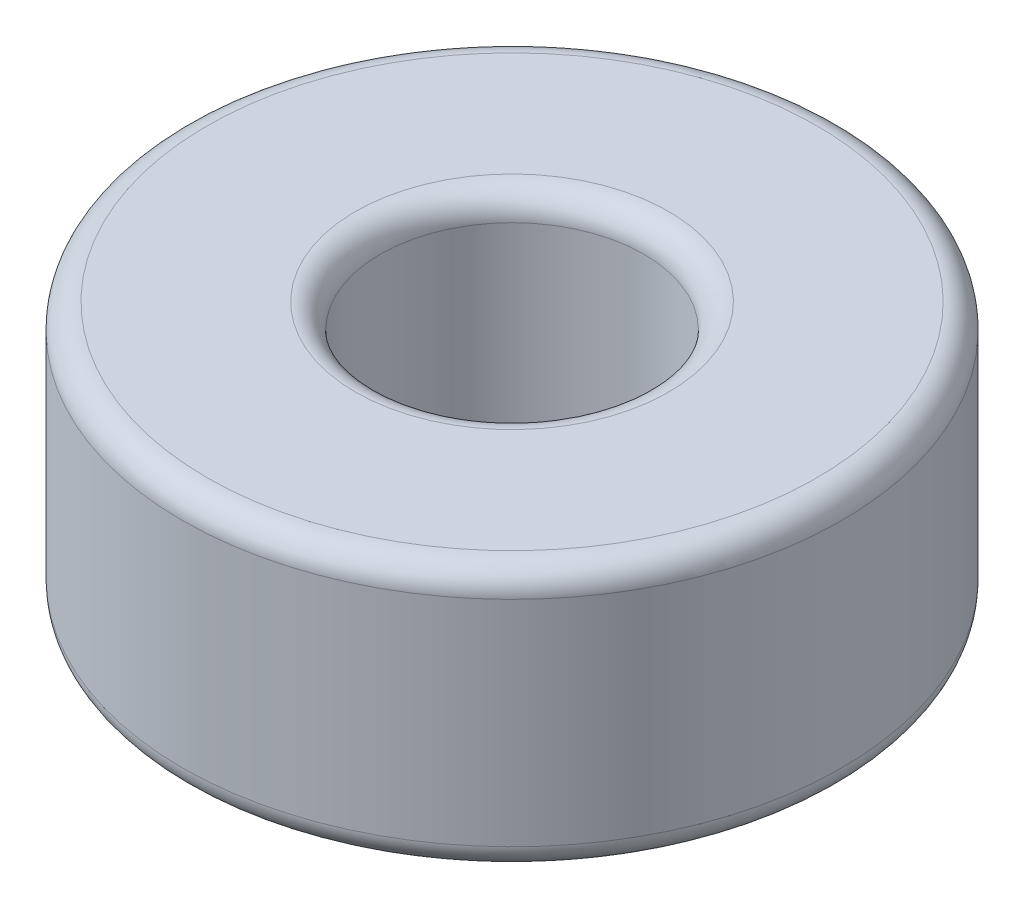
ISO-10303-21;
HEADER;
FILE_DESCRIPTION(('STEP AP214'),'2;1');
FILE_NAME('part.step','',(''),(''),'','','');
FILE_SCHEMA(('AUTOMOTIVE_DESIGN { 1 0 10303 214 1 1 1 1 }'));
ENDSEC;
DATA;
#1=APPLICATION_CONTEXT('core data for automotive mechanical design processes');
#2=APPLICATION_PROTOCOL_DEFINITION('international standard','automotive_design',2000,#1);
#3=PRODUCT_CONTEXT('',#1,'mechanical');
#4=PRODUCT('Part','Part','',(#3));
#5=PRODUCT_RELATED_PRODUCT_CATEGORY('part','',(#4));
#6=PRODUCT_DEFINITION_FORMATION('','',#4);
#7=PRODUCT_DEFINITION_CONTEXT('part definition',#1,'design');
#8=PRODUCT_DEFINITION('design','',#6,#7);
#9=PRODUCT_DEFINITION_SHAPE('','',#8);
#10=(LENGTH_UNIT() NAMED_UNIT(*) SI_UNIT(.MILLI.,.METRE.));
#11=(NAMED_UNIT(*) PLANE_ANGLE_UNIT() SI_UNIT($,.RADIAN.));
#12=(NAMED_UNIT(*) SI_UNIT($,.STERADIAN.) SOLID_ANGLE_UNIT());
#13=UNCERTAINTY_MEASURE_WITH_UNIT(LENGTH_MEASURE(1.E-05),#10,'distance_accuracy_value','');
#14=(GEOMETRIC_REPRESENTATION_CONTEXT(3) GLOBAL_UNCERTAINTY_ASSIGNED_CONTEXT((#13)) GLOBAL_UNIT_ASSIGNED_CONTEXT((#10,
#11,#12)) REPRESENTATION_CONTEXT('',''));
#15=CARTESIAN_POINT('',(0.,0.,0.));
#16=DIRECTION('',(0.,0.,1.));
#17=DIRECTION('',(1.,0.,0.));
#18=AXIS2_PLACEMENT_3D('',#15,#16,#17);
#19=CARTESIAN_POINT('',(0.,2.,0.));
#20=DIRECTION('',(0.,-1.,0.));
#21=DIRECTION('',(0.,0.,-1.));
#22=AXIS2_PLACEMENT_3D('',#19,#20,#21);
#23=CYLINDRICAL_SURFACE('',#22,5.);
#24=CARTESIAN_POINT('',(0.,-1.625,0.));
#25=DIRECTION('',(0.,1.,0.));
#26=DIRECTION('',(0.,0.,1.));
#27=AXIS2_PLACEMENT_3D('',#24,#25,#26);
#28=CIRCLE('',#27,5.);
#29=CARTESIAN_POINT('',(0.,-1.625,5.));
#30=VERTEX_POINT('',#29);
#31=EDGE_CURVE('E57',#30,#30,#28,.T.);
#32=ORIENTED_EDGE('',*,*,#31,.T.);
#33=EDGE_LOOP('',(#32));
#34=FACE_BOUND('',#33,.T.);
#35=CARTESIAN_POINT('',(0.,1.625,0.));
#36=DIRECTION('',(0.,1.,0.));
#37=DIRECTION('',(0.,0.,1.));
#38=AXIS2_PLACEMENT_3D('',#35,#36,#37);
#39=CIRCLE('',#38,5.);
#40=CARTESIAN_POINT('',(0.,1.625,5.));
#41=VERTEX_POINT('',#40);
#42=EDGE_CURVE('E60',#41,#41,#39,.F.);
#43=ORIENTED_EDGE('',*,*,#42,.T.);
#44=EDGE_LOOP('',(#43));
#45=FACE_BOUND('',#44,.T.);
#46=ADVANCED_FACE('F31',(#34,#45),#23,.T.);
#47=CARTESIAN_POINT('',(0.,2.,0.));
#48=DIRECTION('',(0.,1.,0.));
#49=DIRECTION('',(0.,0.,1.));
#50=AXIS2_PLACEMENT_3D('',#47,#48,#49);
#51=PLANE('',#50);
#52=CARTESIAN_POINT('',(0.,2.,0.));
#53=DIRECTION('',(0.,1.,0.));
#54=DIRECTION('',(0.,0.,1.));
#55=AXIS2_PLACEMENT_3D('',#52,#53,#54);
#56=CIRCLE('',#55,4.625);
#57=CARTESIAN_POINT('',(0.,2.,4.625));
#58=VERTEX_POINT('',#57);
#59=EDGE_CURVE('E10',#58,#58,#56,.T.);
#60=ORIENTED_EDGE('',*,*,#59,.T.);
#61=EDGE_LOOP('',(#60));
#62=FACE_BOUND('',#61,.T.);
#63=CARTESIAN_POINT('',(0.,2.,0.));
#64=DIRECTION('',(0.,1.,0.));
#65=DIRECTION('',(0.,0.,1.));
#66=AXIS2_PLACEMENT_3D('',#63,#64,#65);
#67=CIRCLE('',#66,2.375);
#68=CARTESIAN_POINT('',(0.,2.,2.375));
#69=VERTEX_POINT('',#68);
#70=EDGE_CURVE('E38',#69,#69,#67,.F.);
#71=ORIENTED_EDGE('',*,*,#70,.T.);
#72=EDGE_LOOP('',(#71));
#73=FACE_BOUND('',#72,.T.);
#74=ADVANCED_FACE('F78',(#62,#73),#51,.T.);
#75=CARTESIAN_POINT('',(0.,-2.,0.));
#76=DIRECTION('',(0.,1.,0.));
#77=DIRECTION('',(0.,0.,1.));
#78=AXIS2_PLACEMENT_3D('',#75,#76,#77);
#79=PLANE('',#78);
#80=CARTESIAN_POINT('',(0.,-2.,0.));
#81=DIRECTION('',(0.,1.,0.));
#82=DIRECTION('',(0.,0.,1.));
#83=AXIS2_PLACEMENT_3D('',#80,#81,#82);
#84=CIRCLE('',#83,4.625);
#85=CARTESIAN_POINT('',(0.,-2.,4.625));
#86=VERTEX_POINT('',#85);
#87=EDGE_CURVE('E51',#86,#86,#84,.F.);
#88=ORIENTED_EDGE('',*,*,#87,.T.);
#89=EDGE_LOOP('',(#88));
#90=FACE_BOUND('',#89,.T.);
#91=CARTESIAN_POINT('',(0.,-2.,0.));
#92=DIRECTION('',(0.,1.,0.));
#93=DIRECTION('',(0.,0.,1.));
#94=AXIS2_PLACEMENT_3D('',#91,#92,#93);
#95=CIRCLE('',#94,2.375);
#96=CARTESIAN_POINT('',(0.,-2.,2.375));
#97=VERTEX_POINT('',#96);
#98=EDGE_CURVE('E54',#97,#97,#95,.T.);
#99=ORIENTED_EDGE('',*,*,#98,.T.);
#100=EDGE_LOOP('',(#99));
#101=FACE_BOUND('',#100,.T.);
#102=ADVANCED_FACE('F84',(#90,#101),#79,.F.);
#103=CARTESIAN_POINT('',(0.,-2.,0.));
#104=DIRECTION('',(0.,1.,0.));
#105=DIRECTION('',(0.,0.,1.));
#106=AXIS2_PLACEMENT_3D('',#103,#104,#105);
#107=CYLINDRICAL_SURFACE('',#106,2.);
#108=CARTESIAN_POINT('',(0.,-1.625,0.));
#109=DIRECTION('',(0.,1.,0.));
#110=DIRECTION('',(0.,0.,1.));
#111=AXIS2_PLACEMENT_3D('',#108,#109,#110);
#112=CIRCLE('',#111,2.);
#113=CARTESIAN_POINT('',(0.,-1.625,2.));
#114=VERTEX_POINT('',#113);
#115=EDGE_CURVE('E42',#114,#114,#112,.F.);
#116=ORIENTED_EDGE('',*,*,#115,.T.);
#117=EDGE_LOOP('',(#116));
#118=FACE_BOUND('',#117,.T.);
#119=CARTESIAN_POINT('',(0.,1.625,0.));
#120=DIRECTION('',(0.,1.,0.));
#121=DIRECTION('',(0.,0.,1.));
#122=AXIS2_PLACEMENT_3D('',#119,#120,#121);
#123=CIRCLE('',#122,2.);
#124=CARTESIAN_POINT('',(0.,1.625,2.));
#125=VERTEX_POINT('',#124);
#126=EDGE_CURVE('E46',#125,#125,#123,.T.);
#127=ORIENTED_EDGE('',*,*,#126,.T.);
#128=EDGE_LOOP('',(#127));
#129=FACE_BOUND('',#128,.T.);
#130=ADVANCED_FACE('F89',(#118,#129),#107,.F.);
#131=CARTESIAN_POINT('',(0.,-1.625,0.));
#132=DIRECTION('',(0.,1.,0.));
#133=DIRECTION('',(0.,0.,1.));
#134=AXIS2_PLACEMENT_3D('',#131,#132,#133);
#135=TOROIDAL_SURFACE('',#134,4.625,0.375);
#136=ORIENTED_EDGE('',*,*,#87,.F.);
#137=EDGE_LOOP('',(#136));
#138=FACE_BOUND('',#137,.T.);
#139=ORIENTED_EDGE('',*,*,#31,.F.);
#140=EDGE_LOOP('',(#139));
#141=FACE_BOUND('',#140,.T.);
#142=ADVANCED_FACE('F74',(#138,#141),#135,.T.);
#143=CARTESIAN_POINT('',(0.,-1.625,0.));
#144=DIRECTION('',(0.,1.,0.));
#145=DIRECTION('',(0.,0.,1.));
#146=AXIS2_PLACEMENT_3D('',#143,#144,#145);
#147=TOROIDAL_SURFACE('',#146,2.375,0.375);
#148=ORIENTED_EDGE('',*,*,#115,.F.);
#149=EDGE_LOOP('',(#148));
#150=FACE_BOUND('',#149,.T.);
#151=ORIENTED_EDGE('',*,*,#98,.F.);
#152=EDGE_LOOP('',(#151));
#153=FACE_BOUND('',#152,.T.);
#154=ADVANCED_FACE('F68',(#150,#153),#147,.T.);
#155=CARTESIAN_POINT('',(0.,1.625,0.));
#156=DIRECTION('',(0.,1.,0.));
#157=DIRECTION('',(0.,0.,1.));
#158=AXIS2_PLACEMENT_3D('',#155,#156,#157);
#159=TOROIDAL_SURFACE('',#158,4.625,0.375);
#160=ORIENTED_EDGE('',*,*,#42,.F.);
#161=EDGE_LOOP('',(#160));
#162=FACE_BOUND('',#161,.T.);
#163=ORIENTED_EDGE('',*,*,#59,.F.);
#164=EDGE_LOOP('',(#163));
#165=FACE_BOUND('',#164,.T.);
#166=ADVANCED_FACE('F65',(#162,#165),#159,.T.);
#167=CARTESIAN_POINT('',(0.,1.625,0.));
#168=DIRECTION('',(0.,1.,0.));
#169=DIRECTION('',(0.,0.,1.));
#170=AXIS2_PLACEMENT_3D('',#167,#168,#169);
#171=TOROIDAL_SURFACE('',#170,2.375,0.375);
#172=ORIENTED_EDGE('',*,*,#70,.F.);
#173=EDGE_LOOP('',(#172));
#174=FACE_BOUND('',#173,.T.);
#175=ORIENTED_EDGE('',*,*,#126,.F.);
#176=EDGE_LOOP('',(#175));
#177=FACE_BOUND('',#176,.T.);
#178=ADVANCED_FACE('F33',(#174,#177),#171,.T.);
#179=CLOSED_SHELL('',(#46,#74,#102,#130,#142,#154,#166,#178));
#180=MANIFOLD_SOLID_BREP('B2',#179);
#181=ADVANCED_BREP_SHAPE_REPRESENTATION('',(#18,#180),#14);
#182=SHAPE_DEFINITION_REPRESENTATION(#9,#181);
ENDSEC;
END-ISO-10303-21;
